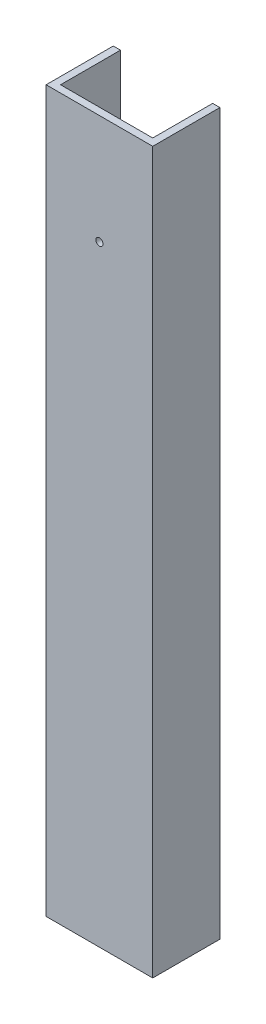
ISO-10303-21;
HEADER;
FILE_DESCRIPTION(('STEP AP214'),'2;1');
FILE_NAME('part.step','',(''),(''),'','','');
FILE_SCHEMA(('AUTOMOTIVE_DESIGN { 1 0 10303 214 1 1 1 1 }'));
ENDSEC;
DATA;
#1=APPLICATION_CONTEXT('core data for automotive mechanical design processes');
#2=APPLICATION_PROTOCOL_DEFINITION('international standard','automotive_design',2000,#1);
#3=PRODUCT_CONTEXT('',#1,'mechanical');
#4=PRODUCT('Part','Part','',(#3));
#5=PRODUCT_RELATED_PRODUCT_CATEGORY('part','',(#4));
#6=PRODUCT_DEFINITION_FORMATION('','',#4);
#7=PRODUCT_DEFINITION_CONTEXT('part definition',#1,'design');
#8=PRODUCT_DEFINITION('design','',#6,#7);
#9=PRODUCT_DEFINITION_SHAPE('','',#8);
#10=(LENGTH_UNIT() NAMED_UNIT(*) SI_UNIT(.MILLI.,.METRE.));
#11=(NAMED_UNIT(*) PLANE_ANGLE_UNIT() SI_UNIT($,.RADIAN.));
#12=(NAMED_UNIT(*) SI_UNIT($,.STERADIAN.) SOLID_ANGLE_UNIT());
#13=UNCERTAINTY_MEASURE_WITH_UNIT(LENGTH_MEASURE(1.E-05),#10,'distance_accuracy_value','');
#14=(GEOMETRIC_REPRESENTATION_CONTEXT(3) GLOBAL_UNCERTAINTY_ASSIGNED_CONTEXT((#13)) GLOBAL_UNIT_ASSIGNED_CONTEXT((#10,
#11,#12)) REPRESENTATION_CONTEXT('',''));
#15=CARTESIAN_POINT('',(0.,0.,0.));
#16=DIRECTION('',(0.,0.,1.));
#17=DIRECTION('',(1.,0.,0.));
#18=AXIS2_PLACEMENT_3D('',#15,#16,#17);
#19=CARTESIAN_POINT('',(-18.5,250.,-11.65));
#20=DIRECTION('',(0.,0.,1.));
#21=DIRECTION('',(1.,0.,0.));
#22=AXIS2_PLACEMENT_3D('',#19,#20,#21);
#23=PLANE('',#22);
#24=DIRECTION('',(-1.,0.,0.));
#25=VECTOR('',#24,1.);
#26=CARTESIAN_POINT('',(-18.5,250.,-11.65));
#27=LINE('',#26,#25);
#28=CARTESIAN_POINT('',(-16.,250.,-11.65));
#29=VERTEX_POINT('',#28);
#30=CARTESIAN_POINT('',(-18.5,250.,-11.65));
#31=VERTEX_POINT('',#30);
#32=EDGE_CURVE('E152',#29,#31,#27,.T.);
#33=ORIENTED_EDGE('',*,*,#32,.F.);
#34=DIRECTION('',(0.,1.,0.));
#35=VECTOR('',#34,1.);
#36=CARTESIAN_POINT('',(-16.,0.,-11.65));
#37=LINE('',#36,#35);
#38=CARTESIAN_POINT('',(-16.,0.,-11.65));
#39=VERTEX_POINT('',#38);
#40=EDGE_CURVE('E144',#39,#29,#37,.T.);
#41=ORIENTED_EDGE('',*,*,#40,.F.);
#42=DIRECTION('',(-1.,0.,0.));
#43=VECTOR('',#42,1.);
#44=CARTESIAN_POINT('',(-18.5,0.,-11.65));
#45=LINE('',#44,#43);
#46=CARTESIAN_POINT('',(-18.5,0.,-11.65));
#47=VERTEX_POINT('',#46);
#48=EDGE_CURVE('E133',#39,#47,#45,.T.);
#49=ORIENTED_EDGE('',*,*,#48,.T.);
#50=DIRECTION('',(0.,-1.,0.));
#51=VECTOR('',#50,1.);
#52=CARTESIAN_POINT('',(-18.5,250.,-11.65));
#53=LINE('',#52,#51);
#54=EDGE_CURVE('E46',#31,#47,#53,.T.);
#55=ORIENTED_EDGE('',*,*,#54,.F.);
#56=EDGE_LOOP('',(#33,#41,#49,#55));
#57=FACE_BOUND('',#56,.T.);
#58=ADVANCED_FACE('F37',(#57),#23,.F.);
#59=CARTESIAN_POINT('',(18.5,250.,11.65));
#60=DIRECTION('',(-1.,0.,0.));
#61=DIRECTION('',(0.,0.,1.));
#62=AXIS2_PLACEMENT_3D('',#59,#60,#61);
#63=PLANE('',#62);
#64=DIRECTION('',(0.,0.,-1.));
#65=VECTOR('',#64,1.);
#66=CARTESIAN_POINT('',(18.5,0.,11.65));
#67=LINE('',#66,#65);
#68=CARTESIAN_POINT('',(18.5,0.,11.65));
#69=VERTEX_POINT('',#68);
#70=CARTESIAN_POINT('',(18.5,0.,-11.65));
#71=VERTEX_POINT('',#70);
#72=EDGE_CURVE('E146',#69,#71,#67,.T.);
#73=ORIENTED_EDGE('',*,*,#72,.T.);
#74=DIRECTION('',(0.,-1.,0.));
#75=VECTOR('',#74,1.);
#76=CARTESIAN_POINT('',(18.5,250.,-11.65));
#77=LINE('',#76,#75);
#78=CARTESIAN_POINT('',(18.5,250.,-11.65));
#79=VERTEX_POINT('',#78);
#80=EDGE_CURVE('E11',#79,#71,#77,.T.);
#81=ORIENTED_EDGE('',*,*,#80,.F.);
#82=DIRECTION('',(0.,0.,-1.));
#83=VECTOR('',#82,1.);
#84=CARTESIAN_POINT('',(18.5,250.,11.65));
#85=LINE('',#84,#83);
#86=CARTESIAN_POINT('',(18.5,250.,11.65));
#87=VERTEX_POINT('',#86);
#88=EDGE_CURVE('E150',#87,#79,#85,.T.);
#89=ORIENTED_EDGE('',*,*,#88,.F.);
#90=DIRECTION('',(0.,-1.,0.));
#91=VECTOR('',#90,1.);
#92=CARTESIAN_POINT('',(18.5,250.,11.65));
#93=LINE('',#92,#91);
#94=EDGE_CURVE('E157',#87,#69,#93,.T.);
#95=ORIENTED_EDGE('',*,*,#94,.T.);
#96=EDGE_LOOP('',(#73,#81,#89,#95));
#97=FACE_BOUND('',#96,.T.);
#98=ADVANCED_FACE('F39',(#97),#63,.F.);
#99=CARTESIAN_POINT('',(16.,0.,-11.65));
#100=VERTEX_POINT('',#99);
#101=EDGE_CURVE('E160',#71,#100,#45,.T.);
#102=ORIENTED_EDGE('',*,*,#101,.T.);
#103=DIRECTION('',(0.,1.,0.));
#104=VECTOR('',#103,1.);
#105=CARTESIAN_POINT('',(16.,0.,-11.65));
#106=LINE('',#105,#104);
#107=CARTESIAN_POINT('',(16.,250.,-11.65));
#108=VERTEX_POINT('',#107);
#109=EDGE_CURVE('E147',#100,#108,#106,.T.);
#110=ORIENTED_EDGE('',*,*,#109,.T.);
#111=EDGE_CURVE('E90',#79,#108,#27,.T.);
#112=ORIENTED_EDGE('',*,*,#111,.F.);
#113=ORIENTED_EDGE('',*,*,#80,.T.);
#114=EDGE_LOOP('',(#102,#110,#112,#113));
#115=FACE_BOUND('',#114,.T.);
#116=ADVANCED_FACE('F193',(#115),#23,.F.);
#117=CARTESIAN_POINT('',(-18.5,250.,11.65));
#118=DIRECTION('',(1.,0.,0.));
#119=DIRECTION('',(0.,0.,-1.));
#120=AXIS2_PLACEMENT_3D('',#117,#118,#119);
#121=PLANE('',#120);
#122=DIRECTION('',(0.,0.,1.));
#123=VECTOR('',#122,1.);
#124=CARTESIAN_POINT('',(-18.5,0.,11.65));
#125=LINE('',#124,#123);
#126=CARTESIAN_POINT('',(-18.5,0.,11.65));
#127=VERTEX_POINT('',#126);
#128=EDGE_CURVE('E163',#47,#127,#125,.T.);
#129=ORIENTED_EDGE('',*,*,#128,.T.);
#130=DIRECTION('',(0.,-1.,0.));
#131=VECTOR('',#130,1.);
#132=CARTESIAN_POINT('',(-18.5,250.,11.65));
#133=LINE('',#132,#131);
#134=CARTESIAN_POINT('',(-18.5,250.,11.65));
#135=VERTEX_POINT('',#134);
#136=EDGE_CURVE('E167',#135,#127,#133,.T.);
#137=ORIENTED_EDGE('',*,*,#136,.F.);
#138=DIRECTION('',(0.,0.,1.));
#139=VECTOR('',#138,1.);
#140=CARTESIAN_POINT('',(-18.5,250.,11.65));
#141=LINE('',#140,#139);
#142=EDGE_CURVE('E154',#31,#135,#141,.T.);
#143=ORIENTED_EDGE('',*,*,#142,.F.);
#144=ORIENTED_EDGE('',*,*,#54,.T.);
#145=EDGE_LOOP('',(#129,#137,#143,#144));
#146=FACE_BOUND('',#145,.T.);
#147=ADVANCED_FACE('F173',(#146),#121,.F.);
#148=CARTESIAN_POINT('',(-18.5,250.,11.65));
#149=DIRECTION('',(0.,0.,-1.));
#150=DIRECTION('',(-1.,0.,0.));
#151=AXIS2_PLACEMENT_3D('',#148,#149,#150);
#152=PLANE('',#151);
#153=CARTESIAN_POINT('',(0.,212.,11.65));
#154=DIRECTION('',(0.,0.,1.));
#155=DIRECTION('',(1.,0.,0.));
#156=AXIS2_PLACEMENT_3D('',#153,#154,#155);
#157=CIRCLE('',#156,1.25);
#158=CARTESIAN_POINT('',(1.25,212.,11.65));
#159=VERTEX_POINT('',#158);
#160=EDGE_CURVE('E139',#159,#159,#157,.T.);
#161=ORIENTED_EDGE('',*,*,#160,.F.);
#162=EDGE_LOOP('',(#161));
#163=FACE_BOUND('',#162,.T.);
#164=DIRECTION('',(1.,0.,0.));
#165=VECTOR('',#164,1.);
#166=CARTESIAN_POINT('',(-18.5,0.,11.65));
#167=LINE('',#166,#165);
#168=EDGE_CURVE('E83',#127,#69,#167,.T.);
#169=ORIENTED_EDGE('',*,*,#168,.T.);
#170=ORIENTED_EDGE('',*,*,#94,.F.);
#171=DIRECTION('',(1.,0.,0.));
#172=VECTOR('',#171,1.);
#173=CARTESIAN_POINT('',(-18.5,250.,11.65));
#174=LINE('',#173,#172);
#175=EDGE_CURVE('E62',#135,#87,#174,.T.);
#176=ORIENTED_EDGE('',*,*,#175,.F.);
#177=ORIENTED_EDGE('',*,*,#136,.T.);
#178=EDGE_LOOP('',(#169,#170,#176,#177));
#179=FACE_BOUND('',#178,.T.);
#180=ADVANCED_FACE('F181',(#163,#179),#152,.F.);
#181=CARTESIAN_POINT('',(0.,250.,0.));
#182=DIRECTION('',(0.,-1.,0.));
#183=DIRECTION('',(0.,0.,-1.));
#184=AXIS2_PLACEMENT_3D('',#181,#182,#183);
#185=PLANE('',#184);
#186=DIRECTION('',(1.,0.,0.));
#187=VECTOR('',#186,1.);
#188=CARTESIAN_POINT('',(-16.,250.,9.15));
#189=LINE('',#188,#187);
#190=CARTESIAN_POINT('',(-16.,250.,9.15));
#191=VERTEX_POINT('',#190);
#192=CARTESIAN_POINT('',(16.,250.,9.15));
#193=VERTEX_POINT('',#192);
#194=EDGE_CURVE('E136',#191,#193,#189,.T.);
#195=ORIENTED_EDGE('',*,*,#194,.F.);
#196=DIRECTION('',(0.,0.,1.));
#197=VECTOR('',#196,1.);
#198=CARTESIAN_POINT('',(-16.,250.,-11.65));
#199=LINE('',#198,#197);
#200=EDGE_CURVE('E119',#29,#191,#199,.T.);
#201=ORIENTED_EDGE('',*,*,#200,.F.);
#202=ORIENTED_EDGE('',*,*,#32,.T.);
#203=ORIENTED_EDGE('',*,*,#142,.T.);
#204=ORIENTED_EDGE('',*,*,#175,.T.);
#205=ORIENTED_EDGE('',*,*,#88,.T.);
#206=ORIENTED_EDGE('',*,*,#111,.T.);
#207=DIRECTION('',(0.,0.,-1.));
#208=VECTOR('',#207,1.);
#209=CARTESIAN_POINT('',(16.,250.,-11.65));
#210=LINE('',#209,#208);
#211=EDGE_CURVE('E134',#193,#108,#210,.T.);
#212=ORIENTED_EDGE('',*,*,#211,.F.);
#213=EDGE_LOOP('',(#195,#201,#202,#203,#204,#205,#206,#212));
#214=FACE_BOUND('',#213,.T.);
#215=ADVANCED_FACE('F183',(#214),#185,.F.);
#216=CARTESIAN_POINT('',(0.,0.,0.));
#217=DIRECTION('',(0.,-1.,0.));
#218=DIRECTION('',(0.,0.,-1.));
#219=AXIS2_PLACEMENT_3D('',#216,#217,#218);
#220=PLANE('',#219);
#221=DIRECTION('',(0.,0.,1.));
#222=VECTOR('',#221,1.);
#223=CARTESIAN_POINT('',(-16.,0.,-11.65));
#224=LINE('',#223,#222);
#225=CARTESIAN_POINT('',(-16.,0.,9.15));
#226=VERTEX_POINT('',#225);
#227=EDGE_CURVE('E116',#39,#226,#224,.T.);
#228=ORIENTED_EDGE('',*,*,#227,.T.);
#229=DIRECTION('',(1.,0.,0.));
#230=VECTOR('',#229,1.);
#231=CARTESIAN_POINT('',(-16.,0.,9.15));
#232=LINE('',#231,#230);
#233=CARTESIAN_POINT('',(16.,0.,9.15));
#234=VERTEX_POINT('',#233);
#235=EDGE_CURVE('E126',#226,#234,#232,.T.);
#236=ORIENTED_EDGE('',*,*,#235,.T.);
#237=DIRECTION('',(0.,0.,-1.));
#238=VECTOR('',#237,1.);
#239=CARTESIAN_POINT('',(16.,0.,-11.65));
#240=LINE('',#239,#238);
#241=EDGE_CURVE('E53',#234,#100,#240,.T.);
#242=ORIENTED_EDGE('',*,*,#241,.T.);
#243=ORIENTED_EDGE('',*,*,#101,.F.);
#244=ORIENTED_EDGE('',*,*,#72,.F.);
#245=ORIENTED_EDGE('',*,*,#168,.F.);
#246=ORIENTED_EDGE('',*,*,#128,.F.);
#247=ORIENTED_EDGE('',*,*,#48,.F.);
#248=EDGE_LOOP('',(#228,#236,#242,#243,#244,#245,#246,#247));
#249=FACE_BOUND('',#248,.T.);
#250=ADVANCED_FACE('F131',(#249),#220,.T.);
#251=CARTESIAN_POINT('',(-16.,0.,-11.65));
#252=DIRECTION('',(-1.,0.,0.));
#253=DIRECTION('',(0.,0.,1.));
#254=AXIS2_PLACEMENT_3D('',#251,#252,#253);
#255=PLANE('',#254);
#256=ORIENTED_EDGE('',*,*,#200,.T.);
#257=DIRECTION('',(0.,1.,0.));
#258=VECTOR('',#257,1.);
#259=CARTESIAN_POINT('',(-16.,0.,9.15));
#260=LINE('',#259,#258);
#261=EDGE_CURVE('E112',#226,#191,#260,.T.);
#262=ORIENTED_EDGE('',*,*,#261,.F.);
#263=ORIENTED_EDGE('',*,*,#227,.F.);
#264=ORIENTED_EDGE('',*,*,#40,.T.);
#265=EDGE_LOOP('',(#256,#262,#263,#264));
#266=FACE_BOUND('',#265,.T.);
#267=ADVANCED_FACE('F114',(#266),#255,.F.);
#268=CARTESIAN_POINT('',(16.,0.,-11.65));
#269=DIRECTION('',(1.,0.,0.));
#270=DIRECTION('',(0.,0.,-1.));
#271=AXIS2_PLACEMENT_3D('',#268,#269,#270);
#272=PLANE('',#271);
#273=ORIENTED_EDGE('',*,*,#211,.T.);
#274=ORIENTED_EDGE('',*,*,#109,.F.);
#275=ORIENTED_EDGE('',*,*,#241,.F.);
#276=DIRECTION('',(0.,1.,0.));
#277=VECTOR('',#276,1.);
#278=CARTESIAN_POINT('',(16.,0.,9.15));
#279=LINE('',#278,#277);
#280=EDGE_CURVE('E123',#234,#193,#279,.T.);
#281=ORIENTED_EDGE('',*,*,#280,.T.);
#282=EDGE_LOOP('',(#273,#274,#275,#281));
#283=FACE_BOUND('',#282,.T.);
#284=ADVANCED_FACE('F205',(#283),#272,.F.);
#285=CARTESIAN_POINT('',(-16.,0.,9.15));
#286=DIRECTION('',(0.,0.,1.));
#287=DIRECTION('',(1.,0.,0.));
#288=AXIS2_PLACEMENT_3D('',#285,#286,#287);
#289=PLANE('',#288);
#290=CARTESIAN_POINT('',(0.,212.,9.14999999999999));
#291=DIRECTION('',(0.,0.,1.));
#292=DIRECTION('',(1.,0.,0.));
#293=AXIS2_PLACEMENT_3D('',#290,#291,#292);
#294=CIRCLE('',#293,1.25);
#295=CARTESIAN_POINT('',(1.25,212.,9.14999999999999));
#296=VERTEX_POINT('',#295);
#297=EDGE_CURVE('E41',#296,#296,#294,.T.);
#298=ORIENTED_EDGE('',*,*,#297,.T.);
#299=EDGE_LOOP('',(#298));
#300=FACE_BOUND('',#299,.T.);
#301=ORIENTED_EDGE('',*,*,#194,.T.);
#302=ORIENTED_EDGE('',*,*,#280,.F.);
#303=ORIENTED_EDGE('',*,*,#235,.F.);
#304=ORIENTED_EDGE('',*,*,#261,.T.);
#305=EDGE_LOOP('',(#301,#302,#303,#304));
#306=FACE_BOUND('',#305,.T.);
#307=ADVANCED_FACE('F127',(#300,#306),#289,.F.);
#308=CARTESIAN_POINT('',(0.,212.,-238.35));
#309=DIRECTION('',(0.,0.,1.));
#310=DIRECTION('',(1.,0.,0.));
#311=AXIS2_PLACEMENT_3D('',#308,#309,#310);
#312=CYLINDRICAL_SURFACE('',#311,1.25);
#313=ORIENTED_EDGE('',*,*,#160,.T.);
#314=EDGE_LOOP('',(#313));
#315=FACE_BOUND('',#314,.T.);
#316=ORIENTED_EDGE('',*,*,#297,.F.);
#317=EDGE_LOOP('',(#316));
#318=FACE_BOUND('',#317,.T.);
#319=ADVANCED_FACE('F211',(#315,#318),#312,.F.);
#320=CLOSED_SHELL('',(#58,#98,#116,#147,#180,#215,#250,#267,#284,#307,#319));
#321=MANIFOLD_SOLID_BREP('B2',#320);
#322=ADVANCED_BREP_SHAPE_REPRESENTATION('',(#18,#321),#14);
#323=SHAPE_DEFINITION_REPRESENTATION(#9,#322);
ENDSEC;
END-ISO-10303-21;
